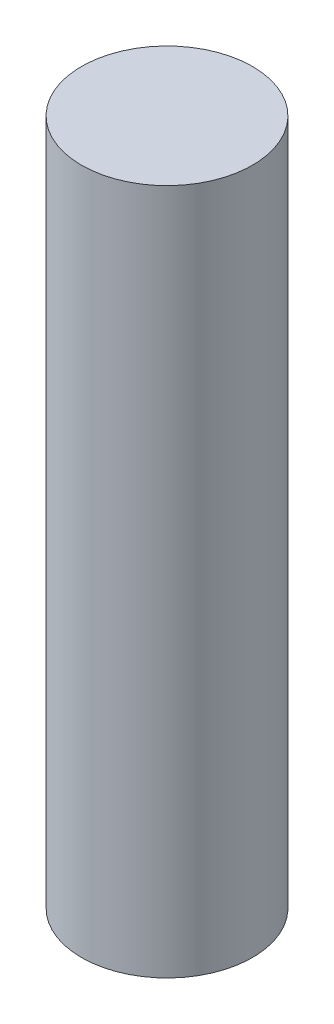
ISO-10303-21;
HEADER;
FILE_DESCRIPTION(('STEP AP214'),'2;1');
FILE_NAME('part.step','',(''),(''),'','','');
FILE_SCHEMA(('AUTOMOTIVE_DESIGN { 1 0 10303 214 1 1 1 1 }'));
ENDSEC;
DATA;
#1=APPLICATION_CONTEXT('core data for automotive mechanical design processes');
#2=APPLICATION_PROTOCOL_DEFINITION('international standard','automotive_design',2000,#1);
#3=PRODUCT_CONTEXT('',#1,'mechanical');
#4=PRODUCT('Part','Part','',(#3));
#5=PRODUCT_RELATED_PRODUCT_CATEGORY('part','',(#4));
#6=PRODUCT_DEFINITION_FORMATION('','',#4);
#7=PRODUCT_DEFINITION_CONTEXT('part definition',#1,'design');
#8=PRODUCT_DEFINITION('design','',#6,#7);
#9=PRODUCT_DEFINITION_SHAPE('','',#8);
#10=(LENGTH_UNIT() NAMED_UNIT(*) SI_UNIT(.MILLI.,.METRE.));
#11=(NAMED_UNIT(*) PLANE_ANGLE_UNIT() SI_UNIT($,.RADIAN.));
#12=(NAMED_UNIT(*) SI_UNIT($,.STERADIAN.) SOLID_ANGLE_UNIT());
#13=UNCERTAINTY_MEASURE_WITH_UNIT(LENGTH_MEASURE(1.E-05),#10,'distance_accuracy_value','');
#14=(GEOMETRIC_REPRESENTATION_CONTEXT(3) GLOBAL_UNCERTAINTY_ASSIGNED_CONTEXT((#13)) GLOBAL_UNIT_ASSIGNED_CONTEXT((#10,
#11,#12)) REPRESENTATION_CONTEXT('',''));
#15=CARTESIAN_POINT('',(0.,0.,0.));
#16=DIRECTION('',(0.,0.,1.));
#17=DIRECTION('',(1.,0.,0.));
#18=AXIS2_PLACEMENT_3D('',#15,#16,#17);
#19=CARTESIAN_POINT('',(0.,19.05,0.));
#20=DIRECTION('',(0.,-1.,0.));
#21=DIRECTION('',(0.,0.,-1.));
#22=AXIS2_PLACEMENT_3D('',#19,#20,#21);
#23=CYLINDRICAL_SURFACE('',#22,2.3749);
#24=CARTESIAN_POINT('',(0.,19.05,0.));
#25=DIRECTION('',(0.,1.,0.));
#26=DIRECTION('',(0.,0.,1.));
#27=AXIS2_PLACEMENT_3D('',#24,#25,#26);
#28=CIRCLE('',#27,2.3749);
#29=CARTESIAN_POINT('',(0.,19.05,2.3749));
#30=VERTEX_POINT('',#29);
#31=EDGE_CURVE('E10',#30,#30,#28,.T.);
#32=ORIENTED_EDGE('',*,*,#31,.F.);
#33=EDGE_LOOP('',(#32));
#34=FACE_BOUND('',#33,.T.);
#35=CARTESIAN_POINT('',(0.,0.,0.));
#36=DIRECTION('',(0.,1.,0.));
#37=DIRECTION('',(0.,0.,1.));
#38=AXIS2_PLACEMENT_3D('',#35,#36,#37);
#39=CIRCLE('',#38,2.3749);
#40=CARTESIAN_POINT('',(0.,0.,2.3749));
#41=VERTEX_POINT('',#40);
#42=EDGE_CURVE('E43',#41,#41,#39,.T.);
#43=ORIENTED_EDGE('',*,*,#42,.T.);
#44=EDGE_LOOP('',(#43));
#45=FACE_BOUND('',#44,.T.);
#46=ADVANCED_FACE('F40',(#34,#45),#23,.T.);
#47=CARTESIAN_POINT('',(0.,19.05,0.));
#48=DIRECTION('',(0.,1.,0.));
#49=DIRECTION('',(0.,0.,1.));
#50=AXIS2_PLACEMENT_3D('',#47,#48,#49);
#51=PLANE('',#50);
#52=ORIENTED_EDGE('',*,*,#31,.T.);
#53=EDGE_LOOP('',(#52));
#54=FACE_BOUND('',#53,.T.);
#55=ADVANCED_FACE('F57',(#54),#51,.T.);
#56=CARTESIAN_POINT('',(0.,0.,0.));
#57=DIRECTION('',(0.,1.,0.));
#58=DIRECTION('',(0.,0.,1.));
#59=AXIS2_PLACEMENT_3D('',#56,#57,#58);
#60=PLANE('',#59);
#61=ORIENTED_EDGE('',*,*,#42,.F.);
#62=EDGE_LOOP('',(#61));
#63=FACE_BOUND('',#62,.T.);
#64=ADVANCED_FACE('F55',(#63),#60,.F.);
#65=CLOSED_SHELL('',(#46,#55,#64));
#66=MANIFOLD_SOLID_BREP('B2',#65);
#67=ADVANCED_BREP_SHAPE_REPRESENTATION('',(#18,#66),#14);
#68=SHAPE_DEFINITION_REPRESENTATION(#9,#67);
ENDSEC;
END-ISO-10303-21;
